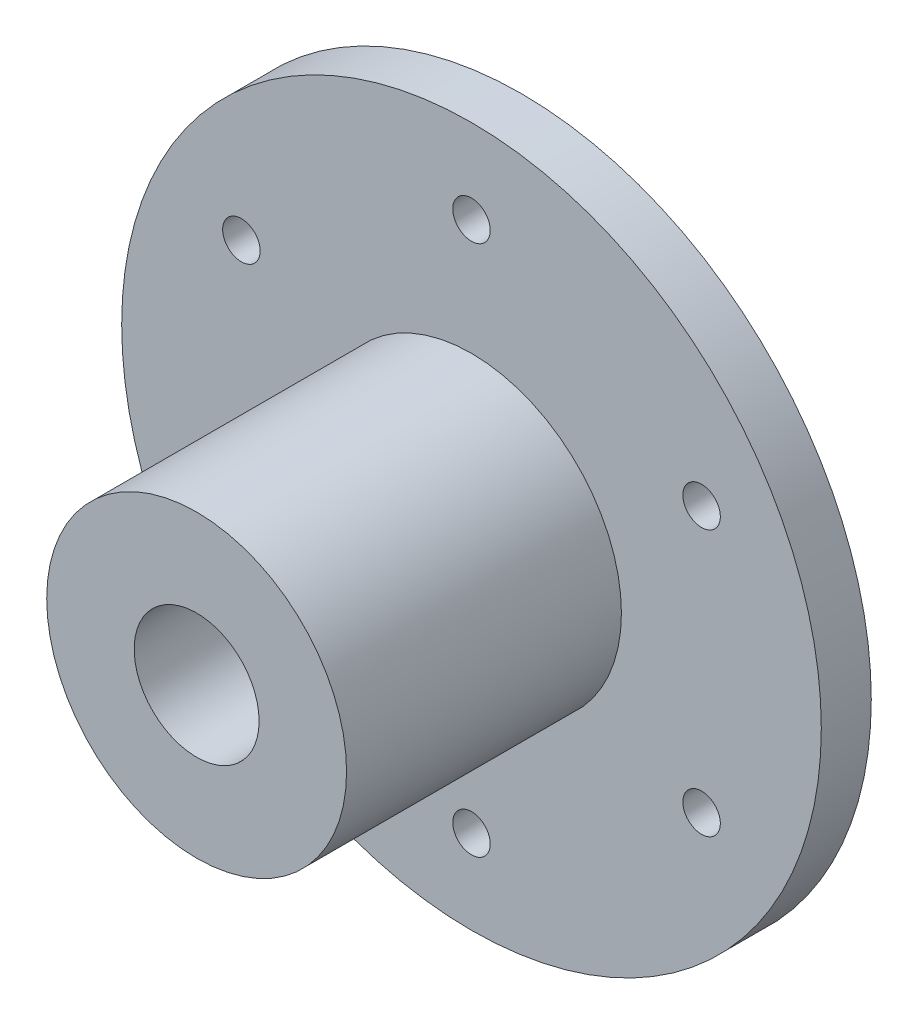
ISO-10303-21;
HEADER;
FILE_DESCRIPTION(('STEP AP214'),'2;1');
FILE_NAME('part.step','',(''),(''),'','','');
FILE_SCHEMA(('AUTOMOTIVE_DESIGN { 1 0 10303 214 1 1 1 1 }'));
ENDSEC;
DATA;
#1=APPLICATION_CONTEXT('core data for automotive mechanical design processes');
#2=APPLICATION_PROTOCOL_DEFINITION('international standard','automotive_design',2000,#1);
#3=PRODUCT_CONTEXT('',#1,'mechanical');
#4=PRODUCT('Part','Part','',(#3));
#5=PRODUCT_RELATED_PRODUCT_CATEGORY('part','',(#4));
#6=PRODUCT_DEFINITION_FORMATION('','',#4);
#7=PRODUCT_DEFINITION_CONTEXT('part definition',#1,'design');
#8=PRODUCT_DEFINITION('design','',#6,#7);
#9=PRODUCT_DEFINITION_SHAPE('','',#8);
#10=(LENGTH_UNIT() NAMED_UNIT(*) SI_UNIT(.MILLI.,.METRE.));
#11=(NAMED_UNIT(*) PLANE_ANGLE_UNIT() SI_UNIT($,.RADIAN.));
#12=(NAMED_UNIT(*) SI_UNIT($,.STERADIAN.) SOLID_ANGLE_UNIT());
#13=UNCERTAINTY_MEASURE_WITH_UNIT(LENGTH_MEASURE(1.E-05),#10,'distance_accuracy_value','');
#14=(GEOMETRIC_REPRESENTATION_CONTEXT(3) GLOBAL_UNCERTAINTY_ASSIGNED_CONTEXT((#13)) GLOBAL_UNIT_ASSIGNED_CONTEXT((#10,
#11,#12)) REPRESENTATION_CONTEXT('',''));
#15=CARTESIAN_POINT('',(0.,0.,0.));
#16=DIRECTION('',(0.,0.,1.));
#17=DIRECTION('',(1.,0.,0.));
#18=AXIS2_PLACEMENT_3D('',#15,#16,#17);
#19=CARTESIAN_POINT('',(0.,0.,4.));
#20=DIRECTION('',(0.,0.,-1.));
#21=DIRECTION('',(-1.,0.,0.));
#22=AXIS2_PLACEMENT_3D('',#19,#20,#21);
#23=CYLINDRICAL_SURFACE('',#22,28.);
#24=CARTESIAN_POINT('',(0.,0.,4.));
#25=DIRECTION('',(0.,0.,1.));
#26=DIRECTION('',(1.,0.,0.));
#27=AXIS2_PLACEMENT_3D('',#24,#25,#26);
#28=CIRCLE('',#27,28.);
#29=CARTESIAN_POINT('',(28.,0.,4.));
#30=VERTEX_POINT('',#29);
#31=EDGE_CURVE('E49',#30,#30,#28,.T.);
#32=ORIENTED_EDGE('',*,*,#31,.F.);
#33=EDGE_LOOP('',(#32));
#34=FACE_BOUND('',#33,.T.);
#35=CARTESIAN_POINT('',(0.,0.,0.));
#36=DIRECTION('',(0.,0.,1.));
#37=DIRECTION('',(1.,0.,0.));
#38=AXIS2_PLACEMENT_3D('',#35,#36,#37);
#39=CIRCLE('',#38,28.);
#40=CARTESIAN_POINT('',(28.,0.,0.));
#41=VERTEX_POINT('',#40);
#42=EDGE_CURVE('E54',#41,#41,#39,.T.);
#43=ORIENTED_EDGE('',*,*,#42,.T.);
#44=EDGE_LOOP('',(#43));
#45=FACE_BOUND('',#44,.T.);
#46=ADVANCED_FACE('F37',(#34,#45),#23,.T.);
#47=CARTESIAN_POINT('',(0.,0.,4.));
#48=DIRECTION('',(0.,0.,1.));
#49=DIRECTION('',(1.,0.,0.));
#50=AXIS2_PLACEMENT_3D('',#47,#48,#49);
#51=PLANE('',#50);
#52=CARTESIAN_POINT('',(18.4165890262439,10.6328226318569,4.));
#53=DIRECTION('',(0.,0.,1.));
#54=DIRECTION('',(0.50000000000001,-0.866025403784433,0.));
#55=AXIS2_PLACEMENT_3D('',#52,#53,#54);
#56=CIRCLE('',#55,1.5);
#57=CARTESIAN_POINT('',(19.1665890262439,9.33378452618028,4.));
#58=VERTEX_POINT('',#57);
#59=EDGE_CURVE('E90',#58,#58,#56,.T.);
#60=ORIENTED_EDGE('',*,*,#59,.F.);
#61=EDGE_LOOP('',(#60));
#62=FACE_BOUND('',#61,.T.);
#63=CARTESIAN_POINT('',(18.4165890262442,-10.6328226318565,4.));
#64=DIRECTION('',(0.,0.,1.));
#65=DIRECTION('',(-0.499999999999992,-0.866025403784443,0.));
#66=AXIS2_PLACEMENT_3D('',#63,#64,#65);
#67=CIRCLE('',#66,1.5);
#68=CARTESIAN_POINT('',(17.6665890262442,-11.9318607375332,4.));
#69=VERTEX_POINT('',#68);
#70=EDGE_CURVE('E89',#69,#69,#67,.T.);
#71=ORIENTED_EDGE('',*,*,#70,.F.);
#72=EDGE_LOOP('',(#71));
#73=FACE_BOUND('',#72,.T.);
#74=CARTESIAN_POINT('',(0.,-21.2656452637134,4.));
#75=DIRECTION('',(0.,0.,1.));
#76=DIRECTION('',(-1.,0.,0.));
#77=AXIS2_PLACEMENT_3D('',#74,#75,#76);
#78=CIRCLE('',#77,1.5);
#79=CARTESIAN_POINT('',(-1.5,-21.2656452637134,4.));
#80=VERTEX_POINT('',#79);
#81=EDGE_CURVE('E97',#80,#80,#78,.T.);
#82=ORIENTED_EDGE('',*,*,#81,.F.);
#83=EDGE_LOOP('',(#82));
#84=FACE_BOUND('',#83,.T.);
#85=CARTESIAN_POINT('',(-18.416589026244,-10.6328226318568,4.));
#86=DIRECTION('',(0.,0.,1.));
#87=DIRECTION('',(-0.500000000000004,0.866025403784436,0.));
#88=AXIS2_PLACEMENT_3D('',#85,#86,#87);
#89=CIRCLE('',#88,1.5);
#90=CARTESIAN_POINT('',(-19.166589026244,-9.33378452618014,4.));
#91=VERTEX_POINT('',#90);
#92=EDGE_CURVE('E103',#91,#91,#89,.T.);
#93=ORIENTED_EDGE('',*,*,#92,.F.);
#94=EDGE_LOOP('',(#93));
#95=FACE_BOUND('',#94,.T.);
#96=CARTESIAN_POINT('',(-18.4165890262441,10.6328226318567,4.));
#97=DIRECTION('',(0.,0.,1.));
#98=DIRECTION('',(0.499999999999998,0.86602540378444,0.));
#99=AXIS2_PLACEMENT_3D('',#96,#97,#98);
#100=CIRCLE('',#99,1.5);
#101=CARTESIAN_POINT('',(-17.6665890262441,11.9318607375333,4.));
#102=VERTEX_POINT('',#101);
#103=EDGE_CURVE('E82',#102,#102,#100,.T.);
#104=ORIENTED_EDGE('',*,*,#103,.F.);
#105=EDGE_LOOP('',(#104));
#106=FACE_BOUND('',#105,.T.);
#107=CARTESIAN_POINT('',(0.,21.2656452637134,4.));
#108=DIRECTION('',(0.,0.,1.));
#109=DIRECTION('',(1.,0.,0.));
#110=AXIS2_PLACEMENT_3D('',#107,#108,#109);
#111=CIRCLE('',#110,1.5);
#112=CARTESIAN_POINT('',(1.5,21.2656452637134,4.));
#113=VERTEX_POINT('',#112);
#114=EDGE_CURVE('E71',#113,#113,#111,.T.);
#115=ORIENTED_EDGE('',*,*,#114,.F.);
#116=EDGE_LOOP('',(#115));
#117=FACE_BOUND('',#116,.T.);
#118=CARTESIAN_POINT('',(0.,0.,4.));
#119=DIRECTION('',(0.,0.,1.));
#120=DIRECTION('',(1.,0.,0.));
#121=AXIS2_PLACEMENT_3D('',#118,#119,#120);
#122=CIRCLE('',#121,12.);
#123=CARTESIAN_POINT('',(12.,0.,4.));
#124=VERTEX_POINT('',#123);
#125=EDGE_CURVE('E10',#124,#124,#122,.T.);
#126=ORIENTED_EDGE('',*,*,#125,.F.);
#127=EDGE_LOOP('',(#126));
#128=FACE_BOUND('',#127,.T.);
#129=ORIENTED_EDGE('',*,*,#31,.T.);
#130=EDGE_LOOP('',(#129));
#131=FACE_BOUND('',#130,.T.);
#132=ADVANCED_FACE('F162',(#62,#73,#84,#95,#106,#117,#128,#131),#51,.T.);
#133=CARTESIAN_POINT('',(0.,0.,0.));
#134=DIRECTION('',(0.,0.,1.));
#135=DIRECTION('',(1.,0.,0.));
#136=AXIS2_PLACEMENT_3D('',#133,#134,#135);
#137=PLANE('',#136);
#138=CARTESIAN_POINT('',(18.4165890262439,10.6328226318569,0.));
#139=DIRECTION('',(0.,0.,-1.));
#140=DIRECTION('',(-0.50000000000001,0.866025403784433,0.));
#141=AXIS2_PLACEMENT_3D('',#138,#139,#140);
#142=CIRCLE('',#141,1.5);
#143=CARTESIAN_POINT('',(17.6665890262439,11.9318607375336,0.));
#144=VERTEX_POINT('',#143);
#145=EDGE_CURVE('E86',#144,#144,#142,.T.);
#146=ORIENTED_EDGE('',*,*,#145,.F.);
#147=EDGE_LOOP('',(#146));
#148=FACE_BOUND('',#147,.T.);
#149=CARTESIAN_POINT('',(18.4165890262442,-10.6328226318565,0.));
#150=DIRECTION('',(0.,0.,-1.));
#151=DIRECTION('',(0.499999999999992,0.866025403784443,0.));
#152=AXIS2_PLACEMENT_3D('',#149,#150,#151);
#153=CIRCLE('',#152,1.5);
#154=CARTESIAN_POINT('',(19.1665890262441,-9.33378452617987,0.));
#155=VERTEX_POINT('',#154);
#156=EDGE_CURVE('E94',#155,#155,#153,.T.);
#157=ORIENTED_EDGE('',*,*,#156,.F.);
#158=EDGE_LOOP('',(#157));
#159=FACE_BOUND('',#158,.T.);
#160=CARTESIAN_POINT('',(0.,-21.2656452637134,0.));
#161=DIRECTION('',(0.,0.,-1.));
#162=DIRECTION('',(1.,0.,0.));
#163=AXIS2_PLACEMENT_3D('',#160,#161,#162);
#164=CIRCLE('',#163,1.5);
#165=CARTESIAN_POINT('',(1.5,-21.2656452637134,0.));
#166=VERTEX_POINT('',#165);
#167=EDGE_CURVE('E100',#166,#166,#164,.T.);
#168=ORIENTED_EDGE('',*,*,#167,.F.);
#169=EDGE_LOOP('',(#168));
#170=FACE_BOUND('',#169,.T.);
#171=CARTESIAN_POINT('',(-18.416589026244,-10.6328226318568,0.));
#172=DIRECTION('',(0.,0.,-1.));
#173=DIRECTION('',(0.500000000000004,-0.866025403784436,0.));
#174=AXIS2_PLACEMENT_3D('',#171,#172,#173);
#175=CIRCLE('',#174,1.5);
#176=CARTESIAN_POINT('',(-17.666589026244,-11.9318607375335,0.));
#177=VERTEX_POINT('',#176);
#178=EDGE_CURVE('E85',#177,#177,#175,.T.);
#179=ORIENTED_EDGE('',*,*,#178,.F.);
#180=EDGE_LOOP('',(#179));
#181=FACE_BOUND('',#180,.T.);
#182=CARTESIAN_POINT('',(-18.4165890262441,10.6328226318567,0.));
#183=DIRECTION('',(0.,0.,-1.));
#184=DIRECTION('',(-0.499999999999998,-0.86602540378444,0.));
#185=AXIS2_PLACEMENT_3D('',#182,#183,#184);
#186=CIRCLE('',#185,1.5);
#187=CARTESIAN_POINT('',(-19.1665890262441,9.33378452618001,0.));
#188=VERTEX_POINT('',#187);
#189=EDGE_CURVE('E79',#188,#188,#186,.T.);
#190=ORIENTED_EDGE('',*,*,#189,.F.);
#191=EDGE_LOOP('',(#190));
#192=FACE_BOUND('',#191,.T.);
#193=CARTESIAN_POINT('',(0.,21.2656452637134,0.));
#194=DIRECTION('',(0.,0.,-1.));
#195=DIRECTION('',(-1.,0.,0.));
#196=AXIS2_PLACEMENT_3D('',#193,#194,#195);
#197=CIRCLE('',#196,1.5);
#198=CARTESIAN_POINT('',(-1.5,21.2656452637134,0.));
#199=VERTEX_POINT('',#198);
#200=EDGE_CURVE('E76',#199,#199,#197,.T.);
#201=ORIENTED_EDGE('',*,*,#200,.F.);
#202=EDGE_LOOP('',(#201));
#203=FACE_BOUND('',#202,.T.);
#204=CARTESIAN_POINT('',(0.,0.,0.));
#205=DIRECTION('',(0.,0.,1.));
#206=DIRECTION('',(1.,0.,0.));
#207=AXIS2_PLACEMENT_3D('',#204,#205,#206);
#208=CIRCLE('',#207,5.);
#209=CARTESIAN_POINT('',(5.,0.,0.));
#210=VERTEX_POINT('',#209);
#211=EDGE_CURVE('E63',#210,#210,#208,.T.);
#212=ORIENTED_EDGE('',*,*,#211,.T.);
#213=EDGE_LOOP('',(#212));
#214=FACE_BOUND('',#213,.T.);
#215=ORIENTED_EDGE('',*,*,#42,.F.);
#216=EDGE_LOOP('',(#215));
#217=FACE_BOUND('',#216,.T.);
#218=ADVANCED_FACE('F158',(#148,#159,#170,#181,#192,#203,#214,#217),#137,.F.);
#219=CARTESIAN_POINT('',(0.,0.,26.));
#220=DIRECTION('',(0.,0.,-1.));
#221=DIRECTION('',(-1.,0.,0.));
#222=AXIS2_PLACEMENT_3D('',#219,#220,#221);
#223=CYLINDRICAL_SURFACE('',#222,12.);
#224=CARTESIAN_POINT('',(0.,-12.,17.723306720916));
#225=CARTESIAN_POINT('',(0.0839046573334568,-11.9999988293786,17.7233031563546));
#226=CARTESIAN_POINT('',(0.167861744581648,-11.9991107073294,17.7162429934144));
#227=CARTESIAN_POINT('',(0.333439681253851,-11.9956532406682,17.6881900681735));
#228=CARTESIAN_POINT('',(0.415057998374247,-11.9930821406486,17.667182758162));
#229=CARTESIAN_POINT('',(0.573537344887832,-11.9865483662664,17.6118641345675));
#230=CARTESIAN_POINT('',(0.650401536087682,-11.9825866287333,17.5775617758301));
#231=CARTESIAN_POINT('',(0.797267684935821,-11.9737122052686,17.4966463505341));
#232=CARTESIAN_POINT('',(0.867270816933823,-11.9687996825047,17.4500353957976));
#233=CARTESIAN_POINT('',(0.998827690158791,-11.958541927838,17.3455515510122));
#234=CARTESIAN_POINT('',(1.06033821896228,-11.9531946881545,17.2876244433082));
#235=CARTESIAN_POINT('',(1.1727916761345,-11.9426863560585,17.162269026794));
#236=CARTESIAN_POINT('',(1.22373406583535,-11.9375252731456,17.094840233968));
#237=CARTESIAN_POINT('',(1.31376609677036,-11.9279538337175,16.9521147343766));
#238=CARTESIAN_POINT('',(1.35281525756464,-11.9235460630675,16.8767923039752));
#239=CARTESIAN_POINT('',(1.41769384594507,-11.9160067707461,16.7205944897476));
#240=CARTESIAN_POINT('',(1.44352377483913,-11.9128752006788,16.6397193166278));
#241=CARTESIAN_POINT('',(1.48109938801486,-11.9082620376217,16.4751602035639));
#242=CARTESIAN_POINT('',(1.49291802883902,-11.9067719006205,16.3914931662935));
#243=CARTESIAN_POINT('',(1.50236132973434,-11.9055841688568,16.2233509628329));
#244=CARTESIAN_POINT('',(1.49998656060145,-11.905886502009,16.1388758292772));
#245=CARTESIAN_POINT('',(1.48117034186874,-11.9082417322185,15.9720238245667));
#246=CARTESIAN_POINT('',(1.46480925779082,-11.910284627762,15.8896377291958));
#247=CARTESIAN_POINT('',(1.41861022990923,-11.9158751985458,15.7287897081846));
#248=CARTESIAN_POINT('',(1.38877201305114,-11.9194229042743,15.6503278620876));
#249=CARTESIAN_POINT('',(1.31637933594699,-11.9276346951879,15.499305921503));
#250=CARTESIAN_POINT('',(1.27378995222458,-11.9323018392687,15.4267627407666));
#251=CARTESIAN_POINT('',(1.17712888167415,-11.9422242685836,15.289822704268));
#252=CARTESIAN_POINT('',(1.12305666964847,-11.947479580714,15.2254262213318));
#253=CARTESIAN_POINT('',(1.00451946645227,-11.9580306593426,15.1061410944823));
#254=CARTESIAN_POINT('',(0.939985204704007,-11.9633264543213,15.0513212658564));
#255=CARTESIAN_POINT('',(0.802594301468354,-11.9733277953351,14.9532813928977));
#256=CARTESIAN_POINT('',(0.729737640790951,-11.978033340009,14.9100613753128));
#257=CARTESIAN_POINT('',(0.577717002818089,-11.9863269133115,14.8364479286376));
#258=CARTESIAN_POINT('',(0.49855091720263,-11.9899145664092,14.8060588085873));
#259=CARTESIAN_POINT('',(0.336184764258634,-11.9955647146804,14.759024424802));
#260=CARTESIAN_POINT('',(0.252984885978401,-11.9976272812552,14.7423785176338));
#261=CARTESIAN_POINT('',(0.0855078983480986,-11.9999855784646,14.7233922663597));
#262=CARTESIAN_POINT('',(0.0012416941191642,-12.0002930168558,14.7209571254976));
#263=CARTESIAN_POINT('',(-0.166497621898498,-11.9991380280326,14.7302113613496));
#264=CARTESIAN_POINT('',(-0.249970750538824,-11.9976756385093,14.7419004372669));
#265=CARTESIAN_POINT('',(-0.413474704632913,-11.9931526125402,14.7789925461806));
#266=CARTESIAN_POINT('',(-0.493515942254824,-11.9900972448832,14.8043503789576));
#267=CARTESIAN_POINT('',(-0.648209792915044,-11.9827303386012,14.8680131920637));
#268=CARTESIAN_POINT('',(-0.722862222879188,-11.9784187573237,14.9063186120108));
#269=CARTESIAN_POINT('',(-0.865082712412456,-11.9689909374607,14.9950186034205));
#270=CARTESIAN_POINT('',(-0.932612255966292,-11.9638706642551,15.0454744947994));
#271=CARTESIAN_POINT('',(-1.05827819377579,-11.9534108539539,15.1569564194365));
#272=CARTESIAN_POINT('',(-1.11641421500211,-11.9480713081614,15.2179828722666));
#273=CARTESIAN_POINT('',(-1.22197917529081,-11.9377386327755,15.3492911709703));
#274=CARTESIAN_POINT('',(-1.26934527634076,-11.932747648328,15.4196237287022));
#275=CARTESIAN_POINT('',(-1.3515917336661,-11.9237124662229,15.5673016678288));
#276=CARTESIAN_POINT('',(-1.38647234023702,-11.9196682495862,15.6446469086019));
#277=CARTESIAN_POINT('',(-1.44265594731992,-11.912999102358,15.8039519124046));
#278=CARTESIAN_POINT('',(-1.46399437647427,-11.9103704711087,15.8858990189448));
#279=CARTESIAN_POINT('',(-1.49260199632071,-11.9068194954447,16.0522482111844));
#280=CARTESIAN_POINT('',(-1.49987184152146,-11.9058970716527,16.1366501824914));
#281=CARTESIAN_POINT('',(-1.5001239216509,-11.9058652618947,16.3048880784388));
#282=CARTESIAN_POINT('',(-1.49320487861956,-11.9067433485117,16.3887238699151));
#283=CARTESIAN_POINT('',(-1.4654846429096,-11.9101866872232,16.554030998523));
#284=CARTESIAN_POINT('',(-1.44468344874346,-11.9127519394985,16.6355023354013));
#285=CARTESIAN_POINT('',(-1.38982024421379,-11.9192766946473,16.7937548949758));
#286=CARTESIAN_POINT('',(-1.35576298858256,-11.9232356975567,16.8705377879291));
#287=CARTESIAN_POINT('',(-1.27536414129019,-11.9321026994689,17.017314713345));
#288=CARTESIAN_POINT('',(-1.22902239570575,-11.9370107103625,17.0873086607279));
#289=CARTESIAN_POINT('',(-1.1250037987595,-11.9472636285134,17.2190254561203));
#290=CARTESIAN_POINT('',(-1.06725337546497,-11.9526112325042,17.280689997489));
#291=CARTESIAN_POINT('',(-0.94221013618103,-11.9631169895574,17.3934908160168));
#292=CARTESIAN_POINT('',(-0.87491507348494,-11.9682750976535,17.4446246073806));
#293=CARTESIAN_POINT('',(-0.732399372512527,-11.9778423395205,17.5350779351792));
#294=CARTESIAN_POINT('',(-0.657149567757702,-11.9822485504698,17.5743518044555));
#295=CARTESIAN_POINT('',(-0.501109741380769,-11.9897858944604,17.6396494666658));
#296=CARTESIAN_POINT('',(-0.420325848522142,-11.9929184122175,17.6656876567281));
#297=CARTESIAN_POINT('',(-0.282603463180755,-11.9968003219665,17.6975423238188));
#298=CARTESIAN_POINT('',(-0.226533398110153,-11.9979943553727,17.7071900861052));
#299=CARTESIAN_POINT('',(-0.113650237927461,-11.9995945879751,17.7200734683319));
#300=CARTESIAN_POINT('',(-0.0568371482976164,-12.0000007929808,17.7233091355556));
#301=CARTESIAN_POINT('',(0.,-12.,17.723306720916));
#302=B_SPLINE_CURVE_WITH_KNOTS('',3,(#224,#225,#226,#227,#228,#229,#230,#231,#232,#233,#234,
#235,#236,#237,#238,#239,#240,#241,#242,#243,#244,#245,#246,#247,#248,#249,#250,#251,#252,#253,
#254,#255,#256,#257,#258,#259,#260,#261,#262,#263,#264,#265,#266,#267,#268,#269,#270,#271,#272,
#273,#274,#275,#276,#277,#278,#279,#280,#281,#282,#283,#284,#285,#286,#287,#288,#289,#290,#291,
#292,#293,#294,#295,#296,#297,#298,#299,#300,#301),.UNSPECIFIED.,.T.,.F.,(4,2,2,2,2,2,2,2,2,2,2,
2,2,2,2,2,2,2,2,2,2,2,2,2,2,2,2,2,2,2,2,2,2,2,2,2,2,2,4),(0.,0.251506363665748,
0.503275476566056,0.754875304909062,1.00643199354644,1.25922487921106,1.51203064680006,
1.76568750191322,2.01933473698084,2.27165535171793,2.52396581930798,2.77483617865015,
3.02571162099745,3.2772805577132,3.52886100308183,3.7821808688185,4.03550131867868,
4.28890677438963,4.54230036542268,4.79400167635153,5.04569762701157,5.29656632336038,
5.54744353847369,5.79961441757053,6.05179530825053,6.30541182904544,6.55902326532923,
6.81196844568555,7.06490185806374,7.31608140721329,7.56726098327729,7.81835054823893,
8.06944325947359,8.32221142615098,8.57503919082008,8.82882841822112,9.0823409921042,
9.25271305912577,9.42308386980262),.UNSPECIFIED.);
#303=CARTESIAN_POINT('',(0.,-12.,17.723306720916));
#304=VERTEX_POINT('',#303);
#305=EDGE_CURVE('E93',#304,#304,#302,.T.);
#306=ORIENTED_EDGE('',*,*,#305,.T.);
#307=EDGE_LOOP('',(#306));
#308=FACE_BOUND('',#307,.T.);
#309=CARTESIAN_POINT('',(0.,0.,26.));
#310=DIRECTION('',(0.,0.,1.));
#311=DIRECTION('',(1.,0.,0.));
#312=AXIS2_PLACEMENT_3D('',#309,#310,#311);
#313=CIRCLE('',#312,12.);
#314=CARTESIAN_POINT('',(12.,0.,26.));
#315=VERTEX_POINT('',#314);
#316=EDGE_CURVE('E57',#315,#315,#313,.T.);
#317=ORIENTED_EDGE('',*,*,#316,.F.);
#318=EDGE_LOOP('',(#317));
#319=FACE_BOUND('',#318,.T.);
#320=ORIENTED_EDGE('',*,*,#125,.T.);
#321=EDGE_LOOP('',(#320));
#322=FACE_BOUND('',#321,.T.);
#323=ADVANCED_FACE('F115',(#308,#319,#322),#223,.T.);
#324=CARTESIAN_POINT('',(0.,0.,26.));
#325=DIRECTION('',(0.,0.,1.));
#326=DIRECTION('',(1.,0.,0.));
#327=AXIS2_PLACEMENT_3D('',#324,#325,#326);
#328=PLANE('',#327);
#329=CARTESIAN_POINT('',(0.,0.,26.));
#330=DIRECTION('',(0.,0.,1.));
#331=DIRECTION('',(1.,0.,0.));
#332=AXIS2_PLACEMENT_3D('',#329,#330,#331);
#333=CIRCLE('',#332,5.);
#334=CARTESIAN_POINT('',(5.,0.,26.));
#335=VERTEX_POINT('',#334);
#336=EDGE_CURVE('E67',#335,#335,#333,.T.);
#337=ORIENTED_EDGE('',*,*,#336,.F.);
#338=EDGE_LOOP('',(#337));
#339=FACE_BOUND('',#338,.T.);
#340=ORIENTED_EDGE('',*,*,#316,.T.);
#341=EDGE_LOOP('',(#340));
#342=FACE_BOUND('',#341,.T.);
#343=ADVANCED_FACE('F151',(#339,#342),#328,.T.);
#344=CARTESIAN_POINT('',(0.,0.,-34.));
#345=DIRECTION('',(0.,0.,1.));
#346=DIRECTION('',(1.,0.,0.));
#347=AXIS2_PLACEMENT_3D('',#344,#345,#346);
#348=CYLINDRICAL_SURFACE('',#347,5.);
#349=CARTESIAN_POINT('',(0.,-5.,17.723306720916));
#350=CARTESIAN_POINT('',(-0.0822886127532998,-4.9999992925055,17.7233057234311));
#351=CARTESIAN_POINT('',(-0.164587318351529,-4.99794915693954,17.716512857292));
#352=CARTESIAN_POINT('',(-0.32678812530488,-4.98997105593691,17.6895853666939));
#353=CARTESIAN_POINT('',(-0.406689504411419,-4.98404193389692,17.6694467628927));
#354=CARTESIAN_POINT('',(-0.561732707754526,-4.96895552501836,17.6165607040057));
#355=CARTESIAN_POINT('',(-0.636881364395372,-4.95980300250425,17.5838318512971));
#356=CARTESIAN_POINT('',(-0.78062418105313,-4.93922109237645,17.5067706278602));
#357=CARTESIAN_POINT('',(-0.849217467469668,-4.92779140192067,17.4624367135206));
#358=CARTESIAN_POINT('',(-0.979871797183743,-4.90350737192774,17.3620827134433));
#359=CARTESIAN_POINT('',(-1.04171807124434,-4.89062383657036,17.3057900950301));
#360=CARTESIAN_POINT('',(-1.15524920923324,-4.86505834210442,17.1836974910058));
#361=CARTESIAN_POINT('',(-1.20693236327441,-4.85237641724501,17.117895908791));
#362=CARTESIAN_POINT('',(-1.29980037723707,-4.82834113993772,16.9768359678784));
#363=CARTESIAN_POINT('',(-1.34072309022213,-4.81702406663875,16.9013982599253));
#364=CARTESIAN_POINT('',(-1.4092139477476,-4.79743620394031,16.7443174666857));
#365=CARTESIAN_POINT('',(-1.43678529919973,-4.78916468313311,16.662675876988));
#366=CARTESIAN_POINT('',(-1.47701633682652,-4.77690870838434,16.4979164547855));
#367=CARTESIAN_POINT('',(-1.49007196234677,-4.77281069324533,16.414903977052));
#368=CARTESIAN_POINT('',(-1.50213730614672,-4.76902789749767,16.2477735646992));
#369=CARTESIAN_POINT('',(-1.50115042761078,-4.76934204760571,16.1636559028569));
#370=CARTESIAN_POINT('',(-1.48546977199812,-4.77424744067778,15.9999228123075));
#371=CARTESIAN_POINT('',(-1.47127205262685,-4.7786838859914,15.9202544705538));
#372=CARTESIAN_POINT('',(-1.43037420427056,-4.79108356228624,15.7644869346425));
#373=CARTESIAN_POINT('',(-1.40367284141641,-4.79904714132351,15.6883880935417));
#374=CARTESIAN_POINT('',(-1.33816026653682,-4.81772733074973,15.5407063712553));
#375=CARTESIAN_POINT('',(-1.29918816934643,-4.82848016115952,15.4691996369607));
#376=CARTESIAN_POINT('',(-1.21035222588683,-4.85150987000064,15.3335746989058));
#377=CARTESIAN_POINT('',(-1.16048574002588,-4.86378711746991,15.2694582915022));
#378=CARTESIAN_POINT('',(-1.04881290765546,-4.88911011297937,15.147620530154));
#379=CARTESIAN_POINT('',(-0.986594907466972,-4.90216654310498,15.0902780568863));
#380=CARTESIAN_POINT('',(-0.853263259313967,-4.92712244063259,14.9867527368517));
#381=CARTESIAN_POINT('',(-0.782149051860888,-4.9390218351841,14.9405705925016));
#382=CARTESIAN_POINT('',(-0.632355038342804,-4.9604316006947,14.8604467984513));
#383=CARTESIAN_POINT('',(-0.553627749747951,-4.96992543668314,14.8265892046661));
#384=CARTESIAN_POINT('',(-0.391245415603519,-4.98533521832222,14.7727071308164));
#385=CARTESIAN_POINT('',(-0.307591751589582,-4.99125216186999,14.7526787923835));
#386=CARTESIAN_POINT('',(-0.140952242668332,-4.99868364643538,14.7276545430166));
#387=CARTESIAN_POINT('',(-0.0580500976011873,-5.0003485041779,14.7221451351144));
#388=CARTESIAN_POINT('',(0.107499605823383,-4.9995292324176,14.7248758766281));
#389=CARTESIAN_POINT('',(0.19014719669078,-4.99704565677756,14.7331141905674));
#390=CARTESIAN_POINT('',(0.350903605309696,-4.98830696987163,14.7626913320275));
#391=CARTESIAN_POINT('',(0.429072772614169,-4.98213829799417,14.7837301084969));
#392=CARTESIAN_POINT('',(0.580754638954521,-4.96674347841533,14.8379499536942));
#393=CARTESIAN_POINT('',(0.654266777025583,-4.95751696321085,14.8711324819539));
#394=CARTESIAN_POINT('',(0.796437189461052,-4.93669654351325,14.9495598863971));
#395=CARTESIAN_POINT('',(0.864943826199669,-4.92505280829675,14.995066061864));
#396=CARTESIAN_POINT('',(0.993523307980147,-4.90073468764318,15.0965314749688));
#397=CARTESIAN_POINT('',(1.05359403235593,-4.8880600443108,15.1524933328037));
#398=CARTESIAN_POINT('',(1.16585744551027,-4.86253171869138,15.2756940292853));
#399=CARTESIAN_POINT('',(1.21768481231504,-4.84968825033268,15.3432685966877));
#400=CARTESIAN_POINT('',(1.30928995072154,-4.82576515238463,15.4864346599295));
#401=CARTESIAN_POINT('',(1.34906803829472,-4.81468547654651,15.5620259454742));
#402=CARTESIAN_POINT('',(1.41517347127168,-4.79567189615055,15.7188392121707));
#403=CARTESIAN_POINT('',(1.4415634693705,-4.78772337843827,15.8000329074526));
#404=CARTESIAN_POINT('',(1.48021730815114,-4.77591594362794,15.9659946898475));
#405=CARTESIAN_POINT('',(1.49248598978779,-4.772055625083,16.0507615417037));
#406=CARTESIAN_POINT('',(1.50221984485059,-4.76899972496087,16.2176682392922));
#407=CARTESIAN_POINT('',(1.5002805530849,-4.76961647442754,16.2997703719336));
#408=CARTESIAN_POINT('',(1.48307505444813,-4.77499401288294,16.4624208242888));
#409=CARTESIAN_POINT('',(1.46780938124716,-4.77975463592551,16.5429692060923));
#410=CARTESIAN_POINT('',(1.42476888804136,-4.79275763670385,16.6992521200588));
#411=CARTESIAN_POINT('',(1.39715175507069,-4.80095604545965,16.7750340082777));
#412=CARTESIAN_POINT('',(1.33031507121129,-4.81990278909136,16.9209491597337));
#413=CARTESIAN_POINT('',(1.29109329962876,-4.83065161194312,16.9910813385567));
#414=CARTESIAN_POINT('',(1.20048763805072,-4.85397676425833,17.1264698374431));
#415=CARTESIAN_POINT('',(1.14871276092994,-4.86660540163797,17.1914554821764));
#416=CARTESIAN_POINT('',(1.03517434629782,-4.89201320450026,17.3120092192239));
#417=CARTESIAN_POINT('',(0.973408217134502,-4.90479240823905,17.3675748603838));
#418=CARTESIAN_POINT('',(0.839465762183249,-4.92950936570649,17.469330133211));
#419=CARTESIAN_POINT('',(0.767037885790609,-4.94141159765674,17.5151981677715));
#420=CARTESIAN_POINT('',(0.615141373983531,-4.96260680455813,17.59404189082));
#421=CARTESIAN_POINT('',(0.535676052998956,-4.97190099931067,17.6270236091905));
#422=CARTESIAN_POINT('',(0.380757712655282,-4.98602174969301,17.6762019965687));
#423=CARTESIAN_POINT('',(0.305786961954235,-4.99122027381068,17.6938183937992));
#424=CARTESIAN_POINT('',(0.15388019523078,-4.99820944494492,17.7173702461576));
#425=CARTESIAN_POINT('',(0.0769445098581401,-5.0000006615474,17.7233076536208));
#426=CARTESIAN_POINT('',(0.,-5.,17.723306720916));
#427=B_SPLINE_CURVE_WITH_KNOTS('',3,(#349,#350,#351,#352,#353,#354,#355,#356,#357,#358,#359,
#360,#361,#362,#363,#364,#365,#366,#367,#368,#369,#370,#371,#372,#373,#374,#375,#376,#377,#378,
#379,#380,#381,#382,#383,#384,#385,#386,#387,#388,#389,#390,#391,#392,#393,#394,#395,#396,#397,
#398,#399,#400,#401,#402,#403,#404,#405,#406,#407,#408,#409,#410,#411,#412,#413,#414,#415,#416,
#417,#418,#419,#420,#421,#422,#423,#424,#425,#426),.UNSPECIFIED.,.T.,.F.,(4,2,2,2,2,2,2,2,2,2,2,
2,2,2,2,2,2,2,2,2,2,2,2,2,2,2,2,2,2,2,2,2,2,2,2,2,2,2,4),(0.,0.24658320361261,0.493239964845999,
0.739533676300873,0.985860164412701,1.23855602948191,1.49129437288633,1.74971481004109,
2.00807314543224,2.25919689356599,2.51025978319089,2.75226016697676,2.99428443658001,
3.23962426447119,3.48502360158555,3.74067104048167,3.99633456531072,4.25371046881689,
4.51101453528808,4.75908809438545,5.00712853550327,5.24956746682327,5.49203554593729,
5.74011305702908,5.98825282000191,6.24540400322819,6.5025484425268,6.75847814951252,
7.01432009460283,7.25950155466943,7.50467319661599,7.74680040402721,7.98897397553107,
8.23996925679931,8.49102974897502,8.74942996156671,9.00770911595235,9.2383169193046,
9.46888616948875),.UNSPECIFIED.);
#428=CARTESIAN_POINT('',(0.,-5.,17.723306720916));
#429=VERTEX_POINT('',#428);
#430=EDGE_CURVE('E40',#429,#429,#427,.T.);
#431=ORIENTED_EDGE('',*,*,#430,.T.);
#432=EDGE_LOOP('',(#431));
#433=FACE_BOUND('',#432,.T.);
#434=ORIENTED_EDGE('',*,*,#336,.T.);
#435=EDGE_LOOP('',(#434));
#436=FACE_BOUND('',#435,.T.);
#437=ORIENTED_EDGE('',*,*,#211,.F.);
#438=EDGE_LOOP('',(#437));
#439=FACE_BOUND('',#438,.T.);
#440=ADVANCED_FACE('F147',(#433,#436,#439),#348,.F.);
#441=CARTESIAN_POINT('',(0.,21.2656452637134,6.99999999999999));
#442=DIRECTION('',(0.,0.,-1.));
#443=DIRECTION('',(-1.,0.,0.));
#444=AXIS2_PLACEMENT_3D('',#441,#442,#443);
#445=CYLINDRICAL_SURFACE('',#444,1.5);
#446=ORIENTED_EDGE('',*,*,#114,.T.);
#447=EDGE_LOOP('',(#446));
#448=FACE_BOUND('',#447,.T.);
#449=ORIENTED_EDGE('',*,*,#200,.T.);
#450=EDGE_LOOP('',(#449));
#451=FACE_BOUND('',#450,.T.);
#452=ADVANCED_FACE('F144',(#448,#451),#445,.F.);
#453=CARTESIAN_POINT('',(-18.4165890262441,10.6328226318567,6.99999999999999));
#454=DIRECTION('',(0.,0.,-1.));
#455=DIRECTION('',(-0.499999999999998,-0.86602540378444,0.));
#456=AXIS2_PLACEMENT_3D('',#453,#454,#455);
#457=CYLINDRICAL_SURFACE('',#456,1.5);
#458=ORIENTED_EDGE('',*,*,#103,.T.);
#459=EDGE_LOOP('',(#458));
#460=FACE_BOUND('',#459,.T.);
#461=ORIENTED_EDGE('',*,*,#189,.T.);
#462=EDGE_LOOP('',(#461));
#463=FACE_BOUND('',#462,.T.);
#464=ADVANCED_FACE('F130',(#460,#463),#457,.F.);
#465=CARTESIAN_POINT('',(-18.416589026244,-10.6328226318568,6.99999999999999));
#466=DIRECTION('',(0.,0.,-1.));
#467=DIRECTION('',(0.500000000000004,-0.866025403784436,0.));
#468=AXIS2_PLACEMENT_3D('',#465,#466,#467);
#469=CYLINDRICAL_SURFACE('',#468,1.5);
#470=ORIENTED_EDGE('',*,*,#92,.T.);
#471=EDGE_LOOP('',(#470));
#472=FACE_BOUND('',#471,.T.);
#473=ORIENTED_EDGE('',*,*,#178,.T.);
#474=EDGE_LOOP('',(#473));
#475=FACE_BOUND('',#474,.T.);
#476=ADVANCED_FACE('F125',(#472,#475),#469,.F.);
#477=CARTESIAN_POINT('',(0.,-21.2656452637134,6.99999999999999));
#478=DIRECTION('',(0.,0.,-1.));
#479=DIRECTION('',(1.,0.,0.));
#480=AXIS2_PLACEMENT_3D('',#477,#478,#479);
#481=CYLINDRICAL_SURFACE('',#480,1.5);
#482=ORIENTED_EDGE('',*,*,#81,.T.);
#483=EDGE_LOOP('',(#482));
#484=FACE_BOUND('',#483,.T.);
#485=ORIENTED_EDGE('',*,*,#167,.T.);
#486=EDGE_LOOP('',(#485));
#487=FACE_BOUND('',#486,.T.);
#488=ADVANCED_FACE('F129',(#484,#487),#481,.F.);
#489=CARTESIAN_POINT('',(18.4165890262442,-10.6328226318565,6.99999999999999));
#490=DIRECTION('',(0.,0.,-1.));
#491=DIRECTION('',(0.499999999999992,0.866025403784443,0.));
#492=AXIS2_PLACEMENT_3D('',#489,#490,#491);
#493=CYLINDRICAL_SURFACE('',#492,1.5);
#494=ORIENTED_EDGE('',*,*,#70,.T.);
#495=EDGE_LOOP('',(#494));
#496=FACE_BOUND('',#495,.T.);
#497=ORIENTED_EDGE('',*,*,#156,.T.);
#498=EDGE_LOOP('',(#497));
#499=FACE_BOUND('',#498,.T.);
#500=ADVANCED_FACE('F134',(#496,#499),#493,.F.);
#501=CARTESIAN_POINT('',(18.4165890262439,10.6328226318569,6.99999999999999));
#502=DIRECTION('',(0.,0.,-1.));
#503=DIRECTION('',(-0.50000000000001,0.866025403784433,0.));
#504=AXIS2_PLACEMENT_3D('',#501,#502,#503);
#505=CYLINDRICAL_SURFACE('',#504,1.5);
#506=ORIENTED_EDGE('',*,*,#59,.T.);
#507=EDGE_LOOP('',(#506));
#508=FACE_BOUND('',#507,.T.);
#509=ORIENTED_EDGE('',*,*,#145,.T.);
#510=EDGE_LOOP('',(#509));
#511=FACE_BOUND('',#510,.T.);
#512=ADVANCED_FACE('F123',(#508,#511),#505,.F.);
#513=CARTESIAN_POINT('',(0.,-15.,16.223306720916));
#514=DIRECTION('',(0.,1.,0.));
#515=DIRECTION('',(0.,0.,1.));
#516=AXIS2_PLACEMENT_3D('',#513,#514,#515);
#517=CYLINDRICAL_SURFACE('',#516,1.5);
#518=ORIENTED_EDGE('',*,*,#430,.F.);
#519=EDGE_LOOP('',(#518));
#520=FACE_BOUND('',#519,.T.);
#521=ORIENTED_EDGE('',*,*,#305,.F.);
#522=EDGE_LOOP('',(#521));
#523=FACE_BOUND('',#522,.T.);
#524=ADVANCED_FACE('F119',(#520,#523),#517,.F.);
#525=CLOSED_SHELL('',(#46,#132,#218,#323,#343,#440,#452,#464,#476,#488,#500,#512,#524));
#526=MANIFOLD_SOLID_BREP('B2',#525);
#527=ADVANCED_BREP_SHAPE_REPRESENTATION('',(#18,#526),#14);
#528=SHAPE_DEFINITION_REPRESENTATION(#9,#527);
ENDSEC;
END-ISO-10303-21;
